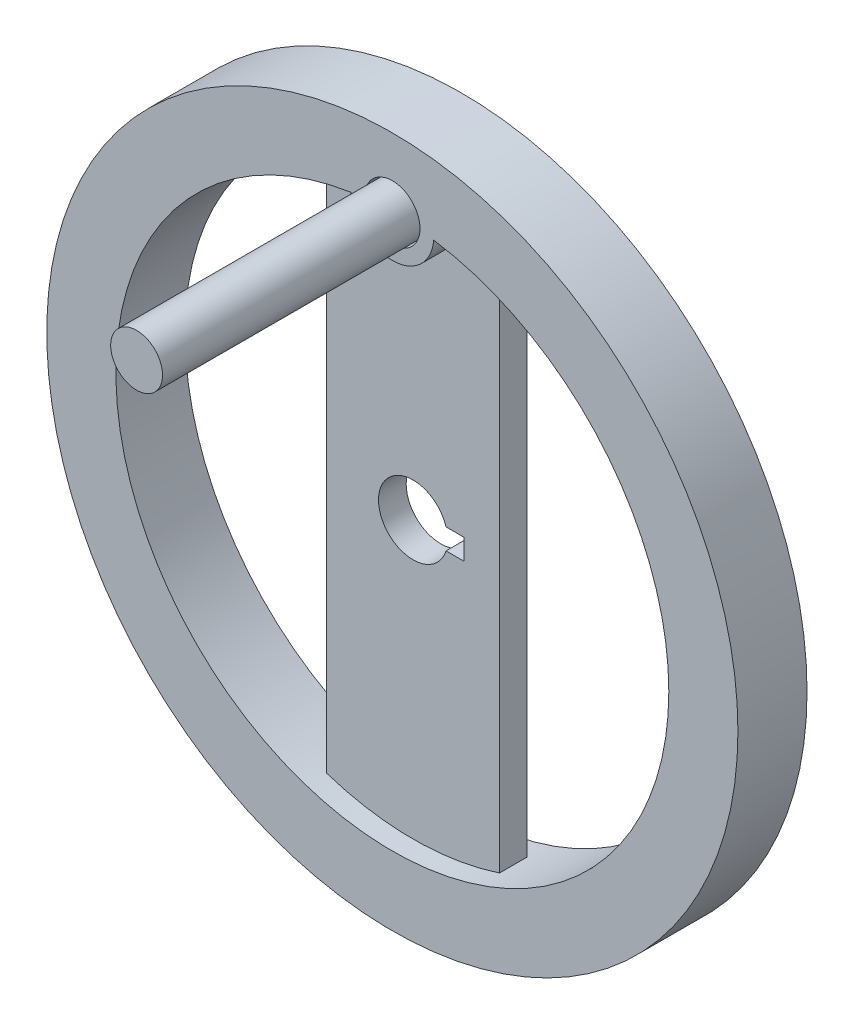
ISO-10303-21;
HEADER;
FILE_DESCRIPTION(('STEP AP214'),'2;1');
FILE_NAME('part.step','',(''),(''),'','','');
FILE_SCHEMA(('AUTOMOTIVE_DESIGN { 1 0 10303 214 1 1 1 1 }'));
ENDSEC;
DATA;
#1=APPLICATION_CONTEXT('core data for automotive mechanical design processes');
#2=APPLICATION_PROTOCOL_DEFINITION('international standard','automotive_design',2000,#1);
#3=PRODUCT_CONTEXT('',#1,'mechanical');
#4=PRODUCT('Part','Part','',(#3));
#5=PRODUCT_RELATED_PRODUCT_CATEGORY('part','',(#4));
#6=PRODUCT_DEFINITION_FORMATION('','',#4);
#7=PRODUCT_DEFINITION_CONTEXT('part definition',#1,'design');
#8=PRODUCT_DEFINITION('design','',#6,#7);
#9=PRODUCT_DEFINITION_SHAPE('','',#8);
#10=(LENGTH_UNIT() NAMED_UNIT(*) SI_UNIT(.MILLI.,.METRE.));
#11=(NAMED_UNIT(*) PLANE_ANGLE_UNIT() SI_UNIT($,.RADIAN.));
#12=(NAMED_UNIT(*) SI_UNIT($,.STERADIAN.) SOLID_ANGLE_UNIT());
#13=UNCERTAINTY_MEASURE_WITH_UNIT(LENGTH_MEASURE(1.E-05),#10,'distance_accuracy_value','');
#14=(GEOMETRIC_REPRESENTATION_CONTEXT(3) GLOBAL_UNCERTAINTY_ASSIGNED_CONTEXT((#13)) GLOBAL_UNIT_ASSIGNED_CONTEXT((#10,
#11,#12)) REPRESENTATION_CONTEXT('',''));
#15=CARTESIAN_POINT('',(0.,0.,0.));
#16=DIRECTION('',(0.,0.,1.));
#17=DIRECTION('',(1.,0.,0.));
#18=AXIS2_PLACEMENT_3D('',#15,#16,#17);
#19=CARTESIAN_POINT('',(0.,40.,21.9705627484771));
#20=DIRECTION('',(0.,0.,-1.));
#21=DIRECTION('',(-1.,0.,0.));
#22=AXIS2_PLACEMENT_3D('',#19,#20,#21);
#23=CYLINDRICAL_SURFACE('',#22,6.);
#24=DIRECTION('',(0.,0.,1.));
#25=VECTOR('',#24,1.);
#26=CARTESIAN_POINT('',(-5.98310120255374,39.55,0.));
#27=LINE('',#26,#25);
#28=CARTESIAN_POINT('',(-5.98310120255374,39.55,2.));
#29=VERTEX_POINT('',#28);
#30=CARTESIAN_POINT('',(-5.98310120255374,39.55,5.));
#31=VERTEX_POINT('',#30);
#32=EDGE_CURVE('E182',#29,#31,#27,.T.);
#33=ORIENTED_EDGE('',*,*,#32,.F.);
#34=CARTESIAN_POINT('',(0.,40.,2.));
#35=DIRECTION('',(0.,0.,1.));
#36=DIRECTION('',(1.,0.,0.));
#37=AXIS2_PLACEMENT_3D('',#34,#35,#36);
#38=CIRCLE('',#37,6.);
#39=CARTESIAN_POINT('',(5.98310120255374,39.55,2.));
#40=VERTEX_POINT('',#39);
#41=EDGE_CURVE('E41',#29,#40,#38,.T.);
#42=ORIENTED_EDGE('',*,*,#41,.T.);
#43=DIRECTION('',(0.,0.,1.));
#44=VECTOR('',#43,1.);
#45=CARTESIAN_POINT('',(5.98310120255374,39.55,0.));
#46=LINE('',#45,#44);
#47=CARTESIAN_POINT('',(5.98310120255374,39.55,5.));
#48=VERTEX_POINT('',#47);
#49=EDGE_CURVE('E180',#48,#40,#46,.F.);
#50=ORIENTED_EDGE('',*,*,#49,.F.);
#51=CARTESIAN_POINT('',(0.,40.,5.));
#52=DIRECTION('',(0.,0.,1.));
#53=DIRECTION('',(1.,0.,0.));
#54=AXIS2_PLACEMENT_3D('',#51,#52,#53);
#55=CIRCLE('',#54,6.);
#56=EDGE_CURVE('E11',#31,#48,#55,.T.);
#57=ORIENTED_EDGE('',*,*,#56,.F.);
#58=EDGE_LOOP('',(#33,#42,#50,#57));
#59=FACE_BOUND('',#58,.T.);
#60=ADVANCED_FACE('F33',(#59),#23,.T.);
#61=CARTESIAN_POINT('',(0.,40.,21.9705627484771));
#62=DIRECTION('',(0.,0.,-1.));
#63=DIRECTION('',(-1.,0.,0.));
#64=AXIS2_PLACEMENT_3D('',#61,#62,#63);
#65=CYLINDRICAL_SURFACE('',#64,4.);
#66=CARTESIAN_POINT('',(0.,40.,5.));
#67=DIRECTION('',(0.,0.,1.));
#68=DIRECTION('',(1.,0.,0.));
#69=AXIS2_PLACEMENT_3D('',#66,#67,#68);
#70=CIRCLE('',#69,4.);
#71=CARTESIAN_POINT('',(4.,40.,5.));
#72=VERTEX_POINT('',#71);
#73=EDGE_CURVE('E36',#72,#72,#70,.T.);
#74=ORIENTED_EDGE('',*,*,#73,.T.);
#75=EDGE_LOOP('',(#74));
#76=FACE_BOUND('',#75,.T.);
#77=CARTESIAN_POINT('',(0.,40.,2.));
#78=DIRECTION('',(0.,0.,1.));
#79=DIRECTION('',(1.,0.,0.));
#80=AXIS2_PLACEMENT_3D('',#77,#78,#79);
#81=CIRCLE('',#80,4.);
#82=CARTESIAN_POINT('',(4.,40.,2.));
#83=VERTEX_POINT('',#82);
#84=EDGE_CURVE('E184',#83,#83,#81,.T.);
#85=ORIENTED_EDGE('',*,*,#84,.F.);
#86=EDGE_LOOP('',(#85));
#87=FACE_BOUND('',#86,.T.);
#88=ADVANCED_FACE('F240',(#76,#87),#65,.F.);
#89=CARTESIAN_POINT('',(0.,0.,5.));
#90=DIRECTION('',(0.,0.,1.));
#91=DIRECTION('',(1.,0.,0.));
#92=AXIS2_PLACEMENT_3D('',#89,#90,#91);
#93=PLANE('',#92);
#94=ORIENTED_EDGE('',*,*,#73,.F.);
#95=EDGE_LOOP('',(#94));
#96=FACE_BOUND('',#95,.T.);
#97=ORIENTED_EDGE('',*,*,#56,.T.);
#98=CARTESIAN_POINT('',(0.,0.,5.));
#99=DIRECTION('',(0.,0.,1.));
#100=DIRECTION('',(1.,0.,0.));
#101=AXIS2_PLACEMENT_3D('',#98,#99,#100);
#102=CIRCLE('',#101,40.);
#103=EDGE_CURVE('E56',#31,#48,#102,.T.);
#104=ORIENTED_EDGE('',*,*,#103,.F.);
#105=EDGE_LOOP('',(#97,#104));
#106=FACE_BOUND('',#105,.T.);
#107=CARTESIAN_POINT('',(0.,0.,5.));
#108=DIRECTION('',(0.,0.,1.));
#109=DIRECTION('',(1.,0.,0.));
#110=AXIS2_PLACEMENT_3D('',#107,#108,#109);
#111=CIRCLE('',#110,50.);
#112=CARTESIAN_POINT('',(50.,0.,5.));
#113=VERTEX_POINT('',#112);
#114=EDGE_CURVE('E165',#113,#113,#111,.T.);
#115=ORIENTED_EDGE('',*,*,#114,.T.);
#116=EDGE_LOOP('',(#115));
#117=FACE_BOUND('',#116,.T.);
#118=ADVANCED_FACE('F244',(#96,#106,#117),#93,.T.);
#119=CARTESIAN_POINT('',(0.,0.,2.));
#120=DIRECTION('',(0.,0.,1.));
#121=DIRECTION('',(1.,0.,0.));
#122=AXIS2_PLACEMENT_3D('',#119,#120,#121);
#123=PLANE('',#122);
#124=CARTESIAN_POINT('',(0.,40.,2.));
#125=DIRECTION('',(0.,0.,1.));
#126=DIRECTION('',(1.,0.,0.));
#127=AXIS2_PLACEMENT_3D('',#124,#125,#126);
#128=CIRCLE('',#127,3.75);
#129=CARTESIAN_POINT('',(3.75,40.,2.));
#130=VERTEX_POINT('',#129);
#131=EDGE_CURVE('E276',#130,#130,#128,.T.);
#132=ORIENTED_EDGE('',*,*,#131,.F.);
#133=EDGE_LOOP('',(#132));
#134=FACE_BOUND('',#133,.T.);
#135=ORIENTED_EDGE('',*,*,#84,.T.);
#136=EDGE_LOOP('',(#135));
#137=FACE_BOUND('',#136,.T.);
#138=ADVANCED_FACE('F249',(#134,#137),#123,.T.);
#139=DIRECTION('',(-1.,0.,0.));
#140=VECTOR('',#139,1.);
#141=CARTESIAN_POINT('',(4.76969600708473,1.5,2.));
#142=LINE('',#141,#140);
#143=CARTESIAN_POINT('',(7.36969600708473,1.5,2.));
#144=VERTEX_POINT('',#143);
#145=CARTESIAN_POINT('',(4.76969600708473,1.5,2.));
#146=VERTEX_POINT('',#145);
#147=EDGE_CURVE('E168',#144,#146,#142,.T.);
#148=ORIENTED_EDGE('',*,*,#147,.F.);
#149=DIRECTION('',(0.,1.,0.));
#150=VECTOR('',#149,1.);
#151=CARTESIAN_POINT('',(7.36969600708473,1.5,2.));
#152=LINE('',#151,#150);
#153=CARTESIAN_POINT('',(7.36969600708473,-1.5,2.));
#154=VERTEX_POINT('',#153);
#155=EDGE_CURVE('E133',#154,#144,#152,.T.);
#156=ORIENTED_EDGE('',*,*,#155,.F.);
#157=DIRECTION('',(1.,0.,0.));
#158=VECTOR('',#157,1.);
#159=CARTESIAN_POINT('',(7.36969600708473,-1.5,2.));
#160=LINE('',#159,#158);
#161=CARTESIAN_POINT('',(4.76969600708473,-1.5,2.));
#162=VERTEX_POINT('',#161);
#163=EDGE_CURVE('E137',#162,#154,#160,.T.);
#164=ORIENTED_EDGE('',*,*,#163,.F.);
#165=CARTESIAN_POINT('',(0.,0.,2.));
#166=DIRECTION('',(0.,0.,1.));
#167=DIRECTION('',(1.,0.,0.));
#168=AXIS2_PLACEMENT_3D('',#165,#166,#167);
#169=CIRCLE('',#168,5.);
#170=EDGE_CURVE('E149',#146,#162,#169,.T.);
#171=ORIENTED_EDGE('',*,*,#170,.F.);
#172=EDGE_LOOP('',(#148,#156,#164,#171));
#173=FACE_BOUND('',#172,.T.);
#174=ORIENTED_EDGE('',*,*,#41,.F.);
#175=CARTESIAN_POINT('',(0.,0.,2.));
#176=DIRECTION('',(0.,0.,1.));
#177=DIRECTION('',(1.,0.,0.));
#178=AXIS2_PLACEMENT_3D('',#175,#176,#177);
#179=CIRCLE('',#178,40.);
#180=CARTESIAN_POINT('',(-12.5,37.9967103839267,2.));
#181=VERTEX_POINT('',#180);
#182=EDGE_CURVE('E135',#29,#181,#179,.T.);
#183=ORIENTED_EDGE('',*,*,#182,.T.);
#184=DIRECTION('',(0.,1.,0.));
#185=VECTOR('',#184,1.);
#186=CARTESIAN_POINT('',(-12.5,37.9967103839267,2.));
#187=LINE('',#186,#185);
#188=CARTESIAN_POINT('',(-12.5,-37.9967103839267,2.));
#189=VERTEX_POINT('',#188);
#190=EDGE_CURVE('E122',#189,#181,#187,.T.);
#191=ORIENTED_EDGE('',*,*,#190,.F.);
#192=CARTESIAN_POINT('',(12.5,-37.9967103839267,2.));
#193=VERTEX_POINT('',#192);
#194=EDGE_CURVE('E117',#189,#193,#179,.T.);
#195=ORIENTED_EDGE('',*,*,#194,.T.);
#196=DIRECTION('',(0.,-1.,0.));
#197=VECTOR('',#196,1.);
#198=CARTESIAN_POINT('',(12.5,37.9967103839267,2.));
#199=LINE('',#198,#197);
#200=CARTESIAN_POINT('',(12.5,37.9967103839267,2.));
#201=VERTEX_POINT('',#200);
#202=EDGE_CURVE('E125',#201,#193,#199,.T.);
#203=ORIENTED_EDGE('',*,*,#202,.F.);
#204=EDGE_CURVE('E49',#201,#40,#179,.T.);
#205=ORIENTED_EDGE('',*,*,#204,.T.);
#206=EDGE_LOOP('',(#174,#183,#191,#195,#203,#205));
#207=FACE_BOUND('',#206,.T.);
#208=ADVANCED_FACE('F131',(#173,#207),#123,.T.);
#209=CARTESIAN_POINT('',(0.,0.,2.));
#210=DIRECTION('',(0.,0.,1.));
#211=DIRECTION('',(1.,0.,0.));
#212=AXIS2_PLACEMENT_3D('',#209,#210,#211);
#213=CYLINDRICAL_SURFACE('',#212,40.);
#214=CARTESIAN_POINT('',(0.,0.,-5.));
#215=DIRECTION('',(0.,0.,1.));
#216=DIRECTION('',(1.,0.,0.));
#217=AXIS2_PLACEMENT_3D('',#214,#215,#216);
#218=CIRCLE('',#217,40.);
#219=CARTESIAN_POINT('',(40.,0.,-5.));
#220=VERTEX_POINT('',#219);
#221=EDGE_CURVE('E196',#220,#220,#218,.T.);
#222=ORIENTED_EDGE('',*,*,#221,.F.);
#223=EDGE_LOOP('',(#222));
#224=FACE_BOUND('',#223,.T.);
#225=CARTESIAN_POINT('',(0.,0.,-2.));
#226=DIRECTION('',(0.,0.,1.));
#227=DIRECTION('',(1.,0.,0.));
#228=AXIS2_PLACEMENT_3D('',#225,#226,#227);
#229=CIRCLE('',#228,40.);
#230=CARTESIAN_POINT('',(-12.5,-37.9967103839267,-2.));
#231=VERTEX_POINT('',#230);
#232=CARTESIAN_POINT('',(12.5,-37.9967103839267,-2.));
#233=VERTEX_POINT('',#232);
#234=EDGE_CURVE('E119',#231,#233,#229,.T.);
#235=ORIENTED_EDGE('',*,*,#234,.T.);
#236=DIRECTION('',(0.,0.,1.));
#237=VECTOR('',#236,1.);
#238=CARTESIAN_POINT('',(12.5,-37.9967103839267,-8.));
#239=LINE('',#238,#237);
#240=EDGE_CURVE('E112',#233,#193,#239,.T.);
#241=ORIENTED_EDGE('',*,*,#240,.T.);
#242=ORIENTED_EDGE('',*,*,#194,.F.);
#243=DIRECTION('',(0.,0.,1.));
#244=VECTOR('',#243,1.);
#245=CARTESIAN_POINT('',(-12.5,-37.9967103839267,-8.));
#246=LINE('',#245,#244);
#247=EDGE_CURVE('E197',#231,#189,#246,.T.);
#248=ORIENTED_EDGE('',*,*,#247,.F.);
#249=EDGE_LOOP('',(#235,#241,#242,#248));
#250=FACE_BOUND('',#249,.T.);
#251=ORIENTED_EDGE('',*,*,#182,.F.);
#252=ORIENTED_EDGE('',*,*,#32,.T.);
#253=ORIENTED_EDGE('',*,*,#103,.T.);
#254=ORIENTED_EDGE('',*,*,#49,.T.);
#255=ORIENTED_EDGE('',*,*,#204,.F.);
#256=DIRECTION('',(0.,0.,1.));
#257=VECTOR('',#256,1.);
#258=CARTESIAN_POINT('',(12.5,37.9967103839267,-8.));
#259=LINE('',#258,#257);
#260=CARTESIAN_POINT('',(12.5,37.9967103839267,-2.));
#261=VERTEX_POINT('',#260);
#262=EDGE_CURVE('E123',#261,#201,#259,.T.);
#263=ORIENTED_EDGE('',*,*,#262,.F.);
#264=CARTESIAN_POINT('',(-12.5,37.9967103839267,-2.));
#265=VERTEX_POINT('',#264);
#266=EDGE_CURVE('E193',#261,#265,#229,.T.);
#267=ORIENTED_EDGE('',*,*,#266,.T.);
#268=DIRECTION('',(0.,0.,1.));
#269=VECTOR('',#268,1.);
#270=CARTESIAN_POINT('',(-12.5,37.9967103839267,-8.));
#271=LINE('',#270,#269);
#272=EDGE_CURVE('E191',#265,#181,#271,.T.);
#273=ORIENTED_EDGE('',*,*,#272,.T.);
#274=EDGE_LOOP('',(#251,#252,#253,#254,#255,#263,#267,#273));
#275=FACE_BOUND('',#274,.T.);
#276=ADVANCED_FACE('F114',(#224,#250,#275),#213,.F.);
#277=CARTESIAN_POINT('',(0.,0.,5.));
#278=DIRECTION('',(0.,0.,-1.));
#279=DIRECTION('',(-1.,0.,0.));
#280=AXIS2_PLACEMENT_3D('',#277,#278,#279);
#281=CYLINDRICAL_SURFACE('',#280,5.);
#282=DIRECTION('',(0.,0.,-1.));
#283=VECTOR('',#282,1.);
#284=CARTESIAN_POINT('',(4.76969600708473,-1.5,5.));
#285=LINE('',#284,#283);
#286=CARTESIAN_POINT('',(4.76969600708473,-1.5,-2.));
#287=VERTEX_POINT('',#286);
#288=EDGE_CURVE('E161',#162,#287,#285,.T.);
#289=ORIENTED_EDGE('',*,*,#288,.T.);
#290=CARTESIAN_POINT('',(0.,0.,-2.));
#291=DIRECTION('',(0.,0.,-1.));
#292=DIRECTION('',(-1.,0.,0.));
#293=AXIS2_PLACEMENT_3D('',#290,#291,#292);
#294=CIRCLE('',#293,5.);
#295=CARTESIAN_POINT('',(4.76969600708473,1.5,-2.));
#296=VERTEX_POINT('',#295);
#297=EDGE_CURVE('E143',#287,#296,#294,.T.);
#298=ORIENTED_EDGE('',*,*,#297,.T.);
#299=DIRECTION('',(0.,0.,-1.));
#300=VECTOR('',#299,1.);
#301=CARTESIAN_POINT('',(4.76969600708473,1.5,5.));
#302=LINE('',#301,#300);
#303=EDGE_CURVE('E152',#146,#296,#302,.T.);
#304=ORIENTED_EDGE('',*,*,#303,.F.);
#305=ORIENTED_EDGE('',*,*,#170,.T.);
#306=EDGE_LOOP('',(#289,#298,#304,#305));
#307=FACE_BOUND('',#306,.T.);
#308=ADVANCED_FACE('F217',(#307),#281,.F.);
#309=CARTESIAN_POINT('',(7.36969600708473,-1.5,5.));
#310=DIRECTION('',(0.,1.,0.));
#311=DIRECTION('',(0.,0.,1.));
#312=AXIS2_PLACEMENT_3D('',#309,#310,#311);
#313=PLANE('',#312);
#314=DIRECTION('',(0.,0.,-1.));
#315=VECTOR('',#314,1.);
#316=CARTESIAN_POINT('',(7.36969600708473,-1.5,5.));
#317=LINE('',#316,#315);
#318=CARTESIAN_POINT('',(7.36969600708473,-1.5,-2.));
#319=VERTEX_POINT('',#318);
#320=EDGE_CURVE('E158',#154,#319,#317,.T.);
#321=ORIENTED_EDGE('',*,*,#320,.T.);
#322=DIRECTION('',(-1.,0.,0.));
#323=VECTOR('',#322,1.);
#324=CARTESIAN_POINT('',(7.36969600708473,-1.5,-2.));
#325=LINE('',#324,#323);
#326=EDGE_CURVE('E145',#319,#287,#325,.T.);
#327=ORIENTED_EDGE('',*,*,#326,.T.);
#328=ORIENTED_EDGE('',*,*,#288,.F.);
#329=ORIENTED_EDGE('',*,*,#163,.T.);
#330=EDGE_LOOP('',(#321,#327,#328,#329));
#331=FACE_BOUND('',#330,.T.);
#332=ADVANCED_FACE('F213',(#331),#313,.T.);
#333=CARTESIAN_POINT('',(7.36969600708473,1.5,5.));
#334=DIRECTION('',(-1.,0.,0.));
#335=DIRECTION('',(0.,0.,1.));
#336=AXIS2_PLACEMENT_3D('',#333,#334,#335);
#337=PLANE('',#336);
#338=DIRECTION('',(0.,0.,-1.));
#339=VECTOR('',#338,1.);
#340=CARTESIAN_POINT('',(7.36969600708473,1.5,5.));
#341=LINE('',#340,#339);
#342=CARTESIAN_POINT('',(7.36969600708473,1.5,-2.));
#343=VERTEX_POINT('',#342);
#344=EDGE_CURVE('E155',#144,#343,#341,.T.);
#345=ORIENTED_EDGE('',*,*,#344,.T.);
#346=DIRECTION('',(0.,-1.,0.));
#347=VECTOR('',#346,1.);
#348=CARTESIAN_POINT('',(7.36969600708473,1.5,-2.));
#349=LINE('',#348,#347);
#350=EDGE_CURVE('E205',#343,#319,#349,.T.);
#351=ORIENTED_EDGE('',*,*,#350,.T.);
#352=ORIENTED_EDGE('',*,*,#320,.F.);
#353=ORIENTED_EDGE('',*,*,#155,.T.);
#354=EDGE_LOOP('',(#345,#351,#352,#353));
#355=FACE_BOUND('',#354,.T.);
#356=ADVANCED_FACE('F224',(#355),#337,.T.);
#357=CARTESIAN_POINT('',(4.76969600708473,1.5,5.));
#358=DIRECTION('',(0.,-1.,0.));
#359=DIRECTION('',(0.,0.,-1.));
#360=AXIS2_PLACEMENT_3D('',#357,#358,#359);
#361=PLANE('',#360);
#362=ORIENTED_EDGE('',*,*,#303,.T.);
#363=DIRECTION('',(1.,0.,0.));
#364=VECTOR('',#363,1.);
#365=CARTESIAN_POINT('',(4.76969600708473,1.5,-2.));
#366=LINE('',#365,#364);
#367=EDGE_CURVE('E173',#296,#343,#366,.T.);
#368=ORIENTED_EDGE('',*,*,#367,.T.);
#369=ORIENTED_EDGE('',*,*,#344,.F.);
#370=ORIENTED_EDGE('',*,*,#147,.T.);
#371=EDGE_LOOP('',(#362,#368,#369,#370));
#372=FACE_BOUND('',#371,.T.);
#373=ADVANCED_FACE('F222',(#372),#361,.T.);
#374=CARTESIAN_POINT('',(0.,0.,-5.));
#375=DIRECTION('',(0.,0.,1.));
#376=DIRECTION('',(1.,0.,0.));
#377=AXIS2_PLACEMENT_3D('',#374,#375,#376);
#378=PLANE('',#377);
#379=ORIENTED_EDGE('',*,*,#221,.T.);
#380=EDGE_LOOP('',(#379));
#381=FACE_BOUND('',#380,.T.);
#382=CARTESIAN_POINT('',(0.,0.,-5.));
#383=DIRECTION('',(0.,0.,1.));
#384=DIRECTION('',(1.,0.,0.));
#385=AXIS2_PLACEMENT_3D('',#382,#383,#384);
#386=CIRCLE('',#385,50.);
#387=CARTESIAN_POINT('',(50.,0.,-5.));
#388=VERTEX_POINT('',#387);
#389=EDGE_CURVE('E164',#388,#388,#386,.T.);
#390=ORIENTED_EDGE('',*,*,#389,.F.);
#391=EDGE_LOOP('',(#390));
#392=FACE_BOUND('',#391,.T.);
#393=ADVANCED_FACE('F235',(#381,#392),#378,.F.);
#394=CARTESIAN_POINT('',(0.,0.,5.));
#395=DIRECTION('',(0.,0.,-1.));
#396=DIRECTION('',(-1.,0.,0.));
#397=AXIS2_PLACEMENT_3D('',#394,#395,#396);
#398=CYLINDRICAL_SURFACE('',#397,50.);
#399=ORIENTED_EDGE('',*,*,#114,.F.);
#400=EDGE_LOOP('',(#399));
#401=FACE_BOUND('',#400,.T.);
#402=ORIENTED_EDGE('',*,*,#389,.T.);
#403=EDGE_LOOP('',(#402));
#404=FACE_BOUND('',#403,.T.);
#405=ADVANCED_FACE('F227',(#401,#404),#398,.T.);
#406=CARTESIAN_POINT('',(0.,0.,-2.));
#407=DIRECTION('',(0.,0.,-1.));
#408=DIRECTION('',(1.,0.,0.));
#409=AXIS2_PLACEMENT_3D('',#406,#407,#408);
#410=PLANE('',#409);
#411=DIRECTION('',(0.,1.,0.));
#412=VECTOR('',#411,1.);
#413=CARTESIAN_POINT('',(12.5,0.,-2.));
#414=LINE('',#413,#412);
#415=EDGE_CURVE('E178',#233,#261,#414,.T.);
#416=ORIENTED_EDGE('',*,*,#415,.F.);
#417=ORIENTED_EDGE('',*,*,#234,.F.);
#418=DIRECTION('',(0.,-1.,0.));
#419=VECTOR('',#418,1.);
#420=CARTESIAN_POINT('',(-12.5,0.,-2.));
#421=LINE('',#420,#419);
#422=EDGE_CURVE('E176',#265,#231,#421,.T.);
#423=ORIENTED_EDGE('',*,*,#422,.F.);
#424=ORIENTED_EDGE('',*,*,#266,.F.);
#425=EDGE_LOOP('',(#416,#417,#423,#424));
#426=FACE_BOUND('',#425,.T.);
#427=ORIENTED_EDGE('',*,*,#326,.F.);
#428=ORIENTED_EDGE('',*,*,#350,.F.);
#429=ORIENTED_EDGE('',*,*,#367,.F.);
#430=ORIENTED_EDGE('',*,*,#297,.F.);
#431=EDGE_LOOP('',(#427,#428,#429,#430));
#432=FACE_BOUND('',#431,.T.);
#433=ADVANCED_FACE('F225',(#426,#432),#410,.T.);
#434=CARTESIAN_POINT('',(-12.5,37.9967103839267,-8.));
#435=DIRECTION('',(1.,0.,0.));
#436=DIRECTION('',(0.,0.,-1.));
#437=AXIS2_PLACEMENT_3D('',#434,#435,#436);
#438=PLANE('',#437);
#439=ORIENTED_EDGE('',*,*,#422,.T.);
#440=ORIENTED_EDGE('',*,*,#247,.T.);
#441=ORIENTED_EDGE('',*,*,#190,.T.);
#442=ORIENTED_EDGE('',*,*,#272,.F.);
#443=EDGE_LOOP('',(#439,#440,#441,#442));
#444=FACE_BOUND('',#443,.T.);
#445=ADVANCED_FACE('F199',(#444),#438,.F.);
#446=CARTESIAN_POINT('',(12.5,37.9967103839267,-8.));
#447=DIRECTION('',(-1.,0.,0.));
#448=DIRECTION('',(0.,0.,1.));
#449=AXIS2_PLACEMENT_3D('',#446,#447,#448);
#450=PLANE('',#449);
#451=ORIENTED_EDGE('',*,*,#415,.T.);
#452=ORIENTED_EDGE('',*,*,#262,.T.);
#453=ORIENTED_EDGE('',*,*,#202,.T.);
#454=ORIENTED_EDGE('',*,*,#240,.F.);
#455=EDGE_LOOP('',(#451,#452,#453,#454));
#456=FACE_BOUND('',#455,.T.);
#457=ADVANCED_FACE('F126',(#456),#450,.F.);
#458=CARTESIAN_POINT('',(0.,40.,42.));
#459=DIRECTION('',(0.,0.,-1.));
#460=DIRECTION('',(-1.,0.,0.));
#461=AXIS2_PLACEMENT_3D('',#458,#459,#460);
#462=CYLINDRICAL_SURFACE('',#461,3.75);
#463=CARTESIAN_POINT('',(0.,40.,42.));
#464=DIRECTION('',(0.,0.,1.));
#465=DIRECTION('',(1.,0.,0.));
#466=AXIS2_PLACEMENT_3D('',#463,#464,#465);
#467=CIRCLE('',#466,3.75);
#468=CARTESIAN_POINT('',(3.75,40.,42.));
#469=VERTEX_POINT('',#468);
#470=EDGE_CURVE('E128',#469,#469,#467,.T.);
#471=ORIENTED_EDGE('',*,*,#470,.F.);
#472=EDGE_LOOP('',(#471));
#473=FACE_BOUND('',#472,.T.);
#474=ORIENTED_EDGE('',*,*,#131,.T.);
#475=EDGE_LOOP('',(#474));
#476=FACE_BOUND('',#475,.T.);
#477=ADVANCED_FACE('F286',(#473,#476),#462,.T.);
#478=CARTESIAN_POINT('',(0.,40.,42.));
#479=DIRECTION('',(0.,0.,1.));
#480=DIRECTION('',(1.,0.,0.));
#481=AXIS2_PLACEMENT_3D('',#478,#479,#480);
#482=PLANE('',#481);
#483=ORIENTED_EDGE('',*,*,#470,.T.);
#484=EDGE_LOOP('',(#483));
#485=FACE_BOUND('',#484,.T.);
#486=ADVANCED_FACE('F284',(#485),#482,.T.);
#487=CLOSED_SHELL('',(#60,#88,#118,#138,#208,#276,#308,#332,#356,#373,#393,#405,#433,#445,#457,
#477,#486));
#488=MANIFOLD_SOLID_BREP('B2',#487);
#489=ADVANCED_BREP_SHAPE_REPRESENTATION('',(#18,#488),#14);
#490=SHAPE_DEFINITION_REPRESENTATION(#9,#489);
ENDSEC;
END-ISO-10303-21;
